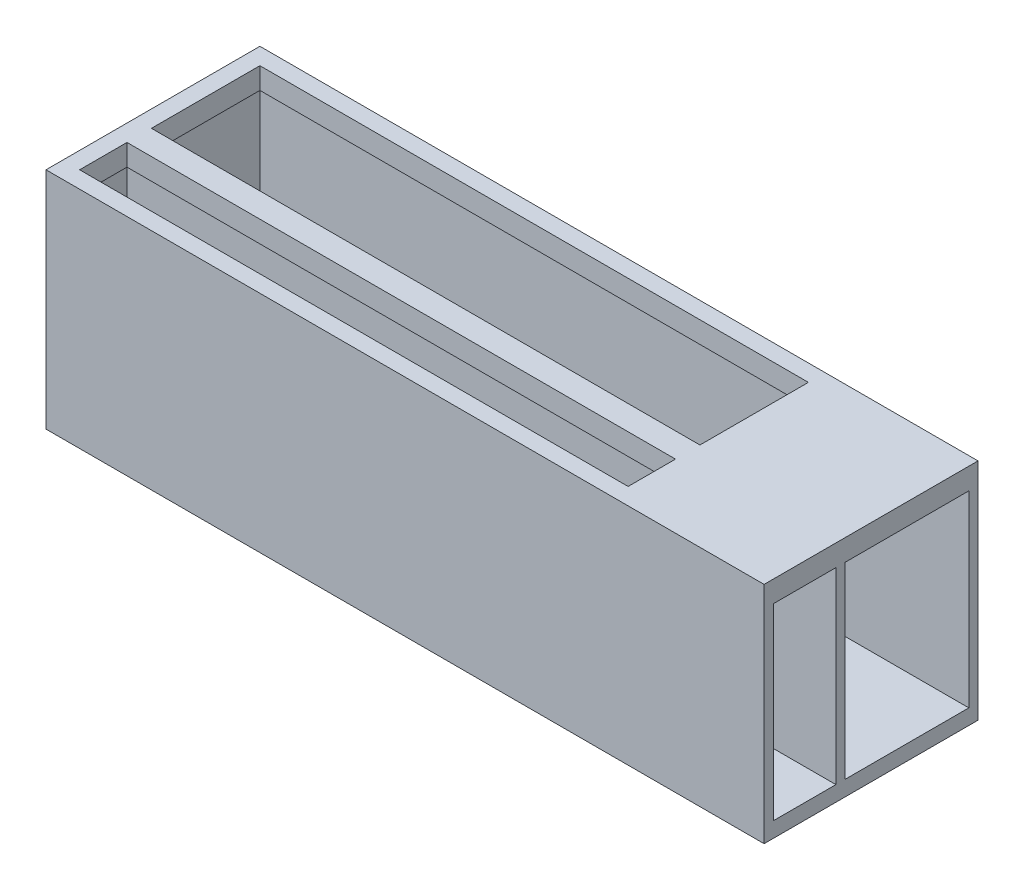
ISO-10303-21;
HEADER;
FILE_DESCRIPTION(('STEP AP214'),'2;1');
FILE_NAME('part.step','',(''),(''),'','','');
FILE_SCHEMA(('AUTOMOTIVE_DESIGN { 1 0 10303 214 1 1 1 1 }'));
ENDSEC;
DATA;
#1=APPLICATION_CONTEXT('core data for automotive mechanical design processes');
#2=APPLICATION_PROTOCOL_DEFINITION('international standard','automotive_design',2000,#1);
#3=PRODUCT_CONTEXT('',#1,'mechanical');
#4=PRODUCT('Part','Part','',(#3));
#5=PRODUCT_RELATED_PRODUCT_CATEGORY('part','',(#4));
#6=PRODUCT_DEFINITION_FORMATION('','',#4);
#7=PRODUCT_DEFINITION_CONTEXT('part definition',#1,'design');
#8=PRODUCT_DEFINITION('design','',#6,#7);
#9=PRODUCT_DEFINITION_SHAPE('','',#8);
#10=(LENGTH_UNIT() NAMED_UNIT(*) SI_UNIT(.MILLI.,.METRE.));
#11=(NAMED_UNIT(*) PLANE_ANGLE_UNIT() SI_UNIT($,.RADIAN.));
#12=(NAMED_UNIT(*) SI_UNIT($,.STERADIAN.) SOLID_ANGLE_UNIT());
#13=UNCERTAINTY_MEASURE_WITH_UNIT(LENGTH_MEASURE(1.E-05),#10,'distance_accuracy_value','');
#14=(GEOMETRIC_REPRESENTATION_CONTEXT(3) GLOBAL_UNCERTAINTY_ASSIGNED_CONTEXT((#13)) GLOBAL_UNIT_ASSIGNED_CONTEXT((#10,
#11,#12)) REPRESENTATION_CONTEXT('',''));
#15=CARTESIAN_POINT('',(0.,0.,0.));
#16=DIRECTION('',(0.,0.,1.));
#17=DIRECTION('',(1.,0.,0.));
#18=AXIS2_PLACEMENT_3D('',#15,#16,#17);
#19=CARTESIAN_POINT('',(0.,37.338,0.));
#20=DIRECTION('',(0.,1.,0.));
#21=DIRECTION('',(0.,0.,1.));
#22=AXIS2_PLACEMENT_3D('',#19,#20,#21);
#23=PLANE('',#22);
#24=DIRECTION('',(0.,0.,1.));
#25=VECTOR('',#24,1.);
#26=CARTESIAN_POINT('',(-59.69,37.338,-17.78));
#27=LINE('',#26,#25);
#28=CARTESIAN_POINT('',(-59.69,37.338,-17.78));
#29=VERTEX_POINT('',#28);
#30=CARTESIAN_POINT('',(-59.69,37.338,17.78));
#31=VERTEX_POINT('',#30);
#32=EDGE_CURVE('E299',#29,#31,#27,.T.);
#33=ORIENTED_EDGE('',*,*,#32,.T.);
#34=DIRECTION('',(1.,0.,0.));
#35=VECTOR('',#34,1.);
#36=CARTESIAN_POINT('',(-59.69,37.338,17.78));
#37=LINE('',#36,#35);
#38=CARTESIAN_POINT('',(59.69,37.338,17.78));
#39=VERTEX_POINT('',#38);
#40=EDGE_CURVE('E302',#31,#39,#37,.T.);
#41=ORIENTED_EDGE('',*,*,#40,.T.);
#42=DIRECTION('',(0.,0.,-1.));
#43=VECTOR('',#42,1.);
#44=CARTESIAN_POINT('',(59.69,37.338,-17.78));
#45=LINE('',#44,#43);
#46=CARTESIAN_POINT('',(59.69,37.338,-17.78));
#47=VERTEX_POINT('',#46);
#48=EDGE_CURVE('E305',#39,#47,#45,.T.);
#49=ORIENTED_EDGE('',*,*,#48,.T.);
#50=DIRECTION('',(-1.,0.,0.));
#51=VECTOR('',#50,1.);
#52=CARTESIAN_POINT('',(-59.69,37.338,-17.78));
#53=LINE('',#52,#51);
#54=EDGE_CURVE('E307',#47,#29,#53,.T.);
#55=ORIENTED_EDGE('',*,*,#54,.T.);
#56=EDGE_LOOP('',(#33,#41,#49,#55));
#57=FACE_BOUND('',#56,.T.);
#58=DIRECTION('',(1.,0.,0.));
#59=VECTOR('',#58,1.);
#60=CARTESIAN_POINT('',(0.,37.338,7.11199999999998));
#61=LINE('',#60,#59);
#62=CARTESIAN_POINT('',(-56.896,37.338,7.11199999999998));
#63=VERTEX_POINT('',#62);
#64=CARTESIAN_POINT('',(34.29,37.338,7.11199999999998));
#65=VERTEX_POINT('',#64);
#66=EDGE_CURVE('E227',#63,#65,#61,.T.);
#67=ORIENTED_EDGE('',*,*,#66,.T.);
#68=DIRECTION('',(0.,0.,1.));
#69=VECTOR('',#68,1.);
#70=CARTESIAN_POINT('',(34.29,37.338,0.));
#71=LINE('',#70,#69);
#72=CARTESIAN_POINT('',(34.29,37.338,14.986));
#73=VERTEX_POINT('',#72);
#74=EDGE_CURVE('E62',#65,#73,#71,.T.);
#75=ORIENTED_EDGE('',*,*,#74,.T.);
#76=DIRECTION('',(1.,0.,0.));
#77=VECTOR('',#76,1.);
#78=CARTESIAN_POINT('',(0.,37.338,14.986));
#79=LINE('',#78,#77);
#80=CARTESIAN_POINT('',(-56.896,37.338,14.986));
#81=VERTEX_POINT('',#80);
#82=EDGE_CURVE('E220',#81,#73,#79,.T.);
#83=ORIENTED_EDGE('',*,*,#82,.F.);
#84=DIRECTION('',(0.,0.,1.));
#85=VECTOR('',#84,1.);
#86=CARTESIAN_POINT('',(-56.896,37.338,0.));
#87=LINE('',#86,#85);
#88=EDGE_CURVE('E224',#63,#81,#87,.T.);
#89=ORIENTED_EDGE('',*,*,#88,.F.);
#90=EDGE_LOOP('',(#67,#75,#83,#89));
#91=FACE_BOUND('',#90,.T.);
#92=DIRECTION('',(1.,0.,0.));
#93=VECTOR('',#92,1.);
#94=CARTESIAN_POINT('',(0.,37.338,-14.986));
#95=LINE('',#94,#93);
#96=CARTESIAN_POINT('',(-56.896,37.338,-14.986));
#97=VERTEX_POINT('',#96);
#98=CARTESIAN_POINT('',(34.29,37.338,-14.986));
#99=VERTEX_POINT('',#98);
#100=EDGE_CURVE('E197',#97,#99,#95,.T.);
#101=ORIENTED_EDGE('',*,*,#100,.T.);
#102=DIRECTION('',(0.,0.,1.));
#103=VECTOR('',#102,1.);
#104=CARTESIAN_POINT('',(34.29,37.338,0.));
#105=LINE('',#104,#103);
#106=CARTESIAN_POINT('',(34.29,37.338,3.04800000000001));
#107=VERTEX_POINT('',#106);
#108=EDGE_CURVE('E54',#99,#107,#105,.T.);
#109=ORIENTED_EDGE('',*,*,#108,.T.);
#110=DIRECTION('',(1.,0.,0.));
#111=VECTOR('',#110,1.);
#112=CARTESIAN_POINT('',(0.,37.338,3.04800000000001));
#113=LINE('',#112,#111);
#114=CARTESIAN_POINT('',(-56.896,37.338,3.04800000000001));
#115=VERTEX_POINT('',#114);
#116=EDGE_CURVE('E186',#115,#107,#113,.T.);
#117=ORIENTED_EDGE('',*,*,#116,.F.);
#118=DIRECTION('',(0.,0.,1.));
#119=VECTOR('',#118,1.);
#120=CARTESIAN_POINT('',(-56.896,37.338,0.));
#121=LINE('',#120,#119);
#122=EDGE_CURVE('E193',#97,#115,#121,.T.);
#123=ORIENTED_EDGE('',*,*,#122,.F.);
#124=EDGE_LOOP('',(#101,#109,#117,#123));
#125=FACE_BOUND('',#124,.T.);
#126=ADVANCED_FACE('F39',(#57,#91,#125),#23,.T.);
#127=CARTESIAN_POINT('',(-97.0979141359151,33.782,4.31799999999998));
#128=DIRECTION('',(0.,1.,0.));
#129=DIRECTION('',(0.,0.,1.));
#130=AXIS2_PLACEMENT_3D('',#127,#128,#129);
#131=PLANE('',#130);
#132=DIRECTION('',(0.,0.,-1.));
#133=VECTOR('',#132,1.);
#134=CARTESIAN_POINT('',(-58.166,33.782,4.31799999999997));
#135=LINE('',#134,#133);
#136=CARTESIAN_POINT('',(-58.166,33.782,4.31800000000001));
#137=VERTEX_POINT('',#136);
#138=CARTESIAN_POINT('',(-58.166,33.782,-16.256));
#139=VERTEX_POINT('',#138);
#140=EDGE_CURVE('E275',#137,#139,#135,.T.);
#141=ORIENTED_EDGE('',*,*,#140,.T.);
#142=DIRECTION('',(1.,0.,0.));
#143=VECTOR('',#142,1.);
#144=CARTESIAN_POINT('',(-97.0979141359151,33.782,-16.256));
#145=LINE('',#144,#143);
#146=CARTESIAN_POINT('',(59.69,33.782,-16.256));
#147=VERTEX_POINT('',#146);
#148=EDGE_CURVE('E292',#139,#147,#145,.T.);
#149=ORIENTED_EDGE('',*,*,#148,.T.);
#150=DIRECTION('',(0.,0.,1.));
#151=VECTOR('',#150,1.);
#152=CARTESIAN_POINT('',(59.69,33.782,4.31800000000001));
#153=LINE('',#152,#151);
#154=CARTESIAN_POINT('',(59.69,33.782,4.31800000000001));
#155=VERTEX_POINT('',#154);
#156=EDGE_CURVE('E287',#147,#155,#153,.T.);
#157=ORIENTED_EDGE('',*,*,#156,.T.);
#158=DIRECTION('',(1.,0.,0.));
#159=VECTOR('',#158,1.);
#160=CARTESIAN_POINT('',(-97.0979141359151,33.782,4.31799999999998));
#161=LINE('',#160,#159);
#162=EDGE_CURVE('E276',#137,#155,#161,.T.);
#163=ORIENTED_EDGE('',*,*,#162,.F.);
#164=EDGE_LOOP('',(#141,#149,#157,#163));
#165=FACE_BOUND('',#164,.T.);
#166=DIRECTION('',(0.,0.,-1.));
#167=VECTOR('',#166,1.);
#168=CARTESIAN_POINT('',(34.29,33.782,0.));
#169=LINE('',#168,#167);
#170=CARTESIAN_POINT('',(34.29,33.782,3.04800000000001));
#171=VERTEX_POINT('',#170);
#172=CARTESIAN_POINT('',(34.29,33.782,-14.986));
#173=VERTEX_POINT('',#172);
#174=EDGE_CURVE('E180',#171,#173,#169,.T.);
#175=ORIENTED_EDGE('',*,*,#174,.T.);
#176=DIRECTION('',(-1.,0.,0.));
#177=VECTOR('',#176,1.);
#178=CARTESIAN_POINT('',(0.,33.782,-14.986));
#179=LINE('',#178,#177);
#180=CARTESIAN_POINT('',(-56.896,33.782,-14.986));
#181=VERTEX_POINT('',#180);
#182=EDGE_CURVE('E212',#173,#181,#179,.T.);
#183=ORIENTED_EDGE('',*,*,#182,.T.);
#184=DIRECTION('',(0.,0.,-1.));
#185=VECTOR('',#184,1.);
#186=CARTESIAN_POINT('',(-56.896,33.782,0.));
#187=LINE('',#186,#185);
#188=CARTESIAN_POINT('',(-56.896,33.782,3.04800000000001));
#189=VERTEX_POINT('',#188);
#190=EDGE_CURVE('E207',#189,#181,#187,.T.);
#191=ORIENTED_EDGE('',*,*,#190,.F.);
#192=DIRECTION('',(-1.,0.,0.));
#193=VECTOR('',#192,1.);
#194=CARTESIAN_POINT('',(0.,33.782,3.04800000000001));
#195=LINE('',#194,#193);
#196=EDGE_CURVE('E192',#171,#189,#195,.T.);
#197=ORIENTED_EDGE('',*,*,#196,.F.);
#198=EDGE_LOOP('',(#175,#183,#191,#197));
#199=FACE_BOUND('',#198,.T.);
#200=ADVANCED_FACE('F352',(#165,#199),#131,.F.);
#201=CARTESIAN_POINT('',(-97.0979141359151,33.782,16.256));
#202=DIRECTION('',(0.,1.,0.));
#203=DIRECTION('',(0.,0.,1.));
#204=AXIS2_PLACEMENT_3D('',#201,#202,#203);
#205=PLANE('',#204);
#206=DIRECTION('',(0.,0.,-1.));
#207=VECTOR('',#206,1.);
#208=CARTESIAN_POINT('',(-58.166,33.782,16.256));
#209=LINE('',#208,#207);
#210=CARTESIAN_POINT('',(-58.166,33.782,16.256));
#211=VERTEX_POINT('',#210);
#212=CARTESIAN_POINT('',(-58.166,33.782,5.84199999999997));
#213=VERTEX_POINT('',#212);
#214=EDGE_CURVE('E245',#211,#213,#209,.T.);
#215=ORIENTED_EDGE('',*,*,#214,.T.);
#216=DIRECTION('',(1.,0.,0.));
#217=VECTOR('',#216,1.);
#218=CARTESIAN_POINT('',(-97.0979141359151,33.782,5.84199999999997));
#219=LINE('',#218,#217);
#220=CARTESIAN_POINT('',(59.69,33.782,5.842));
#221=VERTEX_POINT('',#220);
#222=EDGE_CURVE('E265',#213,#221,#219,.T.);
#223=ORIENTED_EDGE('',*,*,#222,.T.);
#224=DIRECTION('',(0.,0.,1.));
#225=VECTOR('',#224,1.);
#226=CARTESIAN_POINT('',(59.69,33.782,16.256));
#227=LINE('',#226,#225);
#228=CARTESIAN_POINT('',(59.69,33.782,16.256));
#229=VERTEX_POINT('',#228);
#230=EDGE_CURVE('E260',#221,#229,#227,.T.);
#231=ORIENTED_EDGE('',*,*,#230,.T.);
#232=DIRECTION('',(1.,0.,0.));
#233=VECTOR('',#232,1.);
#234=CARTESIAN_POINT('',(-97.0979141359151,33.782,16.256));
#235=LINE('',#234,#233);
#236=EDGE_CURVE('E246',#211,#229,#235,.T.);
#237=ORIENTED_EDGE('',*,*,#236,.F.);
#238=EDGE_LOOP('',(#215,#223,#231,#237));
#239=FACE_BOUND('',#238,.T.);
#240=DIRECTION('',(0.,0.,-1.));
#241=VECTOR('',#240,1.);
#242=CARTESIAN_POINT('',(34.29,33.782,0.));
#243=LINE('',#242,#241);
#244=CARTESIAN_POINT('',(34.29,33.782,14.986));
#245=VERTEX_POINT('',#244);
#246=CARTESIAN_POINT('',(34.29,33.782,7.11199999999998));
#247=VERTEX_POINT('',#246);
#248=EDGE_CURVE('E233',#245,#247,#243,.T.);
#249=ORIENTED_EDGE('',*,*,#248,.T.);
#250=DIRECTION('',(-1.,0.,0.));
#251=VECTOR('',#250,1.);
#252=CARTESIAN_POINT('',(0.,33.782,7.11199999999998));
#253=LINE('',#252,#251);
#254=CARTESIAN_POINT('',(-56.896,33.782,7.11199999999998));
#255=VERTEX_POINT('',#254);
#256=EDGE_CURVE('E215',#247,#255,#253,.T.);
#257=ORIENTED_EDGE('',*,*,#256,.T.);
#258=DIRECTION('',(0.,0.,-1.));
#259=VECTOR('',#258,1.);
#260=CARTESIAN_POINT('',(-56.896,33.782,0.));
#261=LINE('',#260,#259);
#262=CARTESIAN_POINT('',(-56.896,33.782,14.986));
#263=VERTEX_POINT('',#262);
#264=EDGE_CURVE('E205',#263,#255,#261,.T.);
#265=ORIENTED_EDGE('',*,*,#264,.F.);
#266=DIRECTION('',(-1.,0.,0.));
#267=VECTOR('',#266,1.);
#268=CARTESIAN_POINT('',(0.,33.782,14.986));
#269=LINE('',#268,#267);
#270=EDGE_CURVE('E223',#245,#263,#269,.T.);
#271=ORIENTED_EDGE('',*,*,#270,.F.);
#272=EDGE_LOOP('',(#249,#257,#265,#271));
#273=FACE_BOUND('',#272,.T.);
#274=ADVANCED_FACE('F350',(#239,#273),#205,.F.);
#275=CARTESIAN_POINT('',(-59.69,37.338,-17.78));
#276=DIRECTION('',(1.,0.,0.));
#277=DIRECTION('',(0.,0.,-1.));
#278=AXIS2_PLACEMENT_3D('',#275,#276,#277);
#279=PLANE('',#278);
#280=DIRECTION('',(0.,0.,1.));
#281=VECTOR('',#280,1.);
#282=CARTESIAN_POINT('',(-59.69,0.,-17.78));
#283=LINE('',#282,#281);
#284=CARTESIAN_POINT('',(-59.69,0.,-17.78));
#285=VERTEX_POINT('',#284);
#286=CARTESIAN_POINT('',(-59.69,0.,17.78));
#287=VERTEX_POINT('',#286);
#288=EDGE_CURVE('E272',#285,#287,#283,.T.);
#289=ORIENTED_EDGE('',*,*,#288,.T.);
#290=DIRECTION('',(0.,-1.,0.));
#291=VECTOR('',#290,1.);
#292=CARTESIAN_POINT('',(-59.69,37.338,17.78));
#293=LINE('',#292,#291);
#294=EDGE_CURVE('E12',#31,#287,#293,.T.);
#295=ORIENTED_EDGE('',*,*,#294,.F.);
#296=ORIENTED_EDGE('',*,*,#32,.F.);
#297=DIRECTION('',(0.,-1.,0.));
#298=VECTOR('',#297,1.);
#299=CARTESIAN_POINT('',(-59.69,37.338,-17.78));
#300=LINE('',#299,#298);
#301=EDGE_CURVE('E309',#29,#285,#300,.T.);
#302=ORIENTED_EDGE('',*,*,#301,.T.);
#303=EDGE_LOOP('',(#289,#295,#296,#302));
#304=FACE_BOUND('',#303,.T.);
#305=ADVANCED_FACE('F41',(#304),#279,.F.);
#306=CARTESIAN_POINT('',(-59.69,37.338,17.78));
#307=DIRECTION('',(0.,0.,-1.));
#308=DIRECTION('',(-1.,0.,0.));
#309=AXIS2_PLACEMENT_3D('',#306,#307,#308);
#310=PLANE('',#309);
#311=DIRECTION('',(1.,0.,0.));
#312=VECTOR('',#311,1.);
#313=CARTESIAN_POINT('',(-59.69,0.,17.78));
#314=LINE('',#313,#312);
#315=CARTESIAN_POINT('',(59.69,0.,17.78));
#316=VERTEX_POINT('',#315);
#317=EDGE_CURVE('E312',#287,#316,#314,.T.);
#318=ORIENTED_EDGE('',*,*,#317,.T.);
#319=DIRECTION('',(0.,-1.,0.));
#320=VECTOR('',#319,1.);
#321=CARTESIAN_POINT('',(59.69,37.338,17.78));
#322=LINE('',#321,#320);
#323=EDGE_CURVE('E47',#39,#316,#322,.T.);
#324=ORIENTED_EDGE('',*,*,#323,.F.);
#325=ORIENTED_EDGE('',*,*,#40,.F.);
#326=ORIENTED_EDGE('',*,*,#294,.T.);
#327=EDGE_LOOP('',(#318,#324,#325,#326));
#328=FACE_BOUND('',#327,.T.);
#329=ADVANCED_FACE('F342',(#328),#310,.F.);
#330=CARTESIAN_POINT('',(59.69,37.338,-17.78));
#331=DIRECTION('',(-1.,0.,0.));
#332=DIRECTION('',(0.,0.,1.));
#333=AXIS2_PLACEMENT_3D('',#330,#331,#332);
#334=PLANE('',#333);
#335=DIRECTION('',(0.,0.,-1.));
#336=VECTOR('',#335,1.);
#337=CARTESIAN_POINT('',(59.69,2.54,16.256));
#338=LINE('',#337,#336);
#339=CARTESIAN_POINT('',(59.69,2.54,16.256));
#340=VERTEX_POINT('',#339);
#341=CARTESIAN_POINT('',(59.69,2.54,5.84199999999999));
#342=VERTEX_POINT('',#341);
#343=EDGE_CURVE('E253',#340,#342,#338,.T.);
#344=ORIENTED_EDGE('',*,*,#343,.F.);
#345=DIRECTION('',(0.,-1.,0.));
#346=VECTOR('',#345,1.);
#347=CARTESIAN_POINT('',(59.69,33.782,16.256));
#348=LINE('',#347,#346);
#349=EDGE_CURVE('E251',#229,#340,#348,.T.);
#350=ORIENTED_EDGE('',*,*,#349,.F.);
#351=ORIENTED_EDGE('',*,*,#230,.F.);
#352=DIRECTION('',(0.,1.,0.));
#353=VECTOR('',#352,1.);
#354=CARTESIAN_POINT('',(59.69,33.782,5.842));
#355=LINE('',#354,#353);
#356=EDGE_CURVE('E257',#342,#221,#355,.T.);
#357=ORIENTED_EDGE('',*,*,#356,.F.);
#358=EDGE_LOOP('',(#344,#350,#351,#357));
#359=FACE_BOUND('',#358,.T.);
#360=DIRECTION('',(0.,0.,-1.));
#361=VECTOR('',#360,1.);
#362=CARTESIAN_POINT('',(59.69,2.54,4.318));
#363=LINE('',#362,#361);
#364=CARTESIAN_POINT('',(59.69,2.54,4.318));
#365=VERTEX_POINT('',#364);
#366=CARTESIAN_POINT('',(59.69,2.54,-16.256));
#367=VERTEX_POINT('',#366);
#368=EDGE_CURVE('E281',#365,#367,#363,.T.);
#369=ORIENTED_EDGE('',*,*,#368,.F.);
#370=DIRECTION('',(0.,-1.,0.));
#371=VECTOR('',#370,1.);
#372=CARTESIAN_POINT('',(59.69,33.782,4.31800000000001));
#373=LINE('',#372,#371);
#374=EDGE_CURVE('E209',#155,#365,#373,.T.);
#375=ORIENTED_EDGE('',*,*,#374,.F.);
#376=ORIENTED_EDGE('',*,*,#156,.F.);
#377=DIRECTION('',(0.,1.,0.));
#378=VECTOR('',#377,1.);
#379=CARTESIAN_POINT('',(59.69,33.782,-16.256));
#380=LINE('',#379,#378);
#381=EDGE_CURVE('E284',#367,#147,#380,.T.);
#382=ORIENTED_EDGE('',*,*,#381,.F.);
#383=EDGE_LOOP('',(#369,#375,#376,#382));
#384=FACE_BOUND('',#383,.T.);
#385=DIRECTION('',(0.,0.,-1.));
#386=VECTOR('',#385,1.);
#387=CARTESIAN_POINT('',(59.69,0.,-17.78));
#388=LINE('',#387,#386);
#389=CARTESIAN_POINT('',(59.69,0.,-17.78));
#390=VERTEX_POINT('',#389);
#391=EDGE_CURVE('E314',#316,#390,#388,.T.);
#392=ORIENTED_EDGE('',*,*,#391,.T.);
#393=DIRECTION('',(0.,-1.,0.));
#394=VECTOR('',#393,1.);
#395=CARTESIAN_POINT('',(59.69,37.338,-17.78));
#396=LINE('',#395,#394);
#397=EDGE_CURVE('E319',#47,#390,#396,.T.);
#398=ORIENTED_EDGE('',*,*,#397,.F.);
#399=ORIENTED_EDGE('',*,*,#48,.F.);
#400=ORIENTED_EDGE('',*,*,#323,.T.);
#401=EDGE_LOOP('',(#392,#398,#399,#400));
#402=FACE_BOUND('',#401,.T.);
#403=ADVANCED_FACE('F326',(#359,#384,#402),#334,.F.);
#404=CARTESIAN_POINT('',(-59.69,37.338,-17.78));
#405=DIRECTION('',(0.,0.,1.));
#406=DIRECTION('',(1.,0.,0.));
#407=AXIS2_PLACEMENT_3D('',#404,#405,#406);
#408=PLANE('',#407);
#409=DIRECTION('',(-1.,0.,0.));
#410=VECTOR('',#409,1.);
#411=CARTESIAN_POINT('',(-59.69,0.,-17.78));
#412=LINE('',#411,#410);
#413=EDGE_CURVE('E303',#390,#285,#412,.T.);
#414=ORIENTED_EDGE('',*,*,#413,.T.);
#415=ORIENTED_EDGE('',*,*,#301,.F.);
#416=ORIENTED_EDGE('',*,*,#54,.F.);
#417=ORIENTED_EDGE('',*,*,#397,.T.);
#418=EDGE_LOOP('',(#414,#415,#416,#417));
#419=FACE_BOUND('',#418,.T.);
#420=ADVANCED_FACE('F335',(#419),#408,.F.);
#421=CARTESIAN_POINT('',(0.,0.,0.));
#422=DIRECTION('',(0.,1.,0.));
#423=DIRECTION('',(0.,0.,1.));
#424=AXIS2_PLACEMENT_3D('',#421,#422,#423);
#425=PLANE('',#424);
#426=ORIENTED_EDGE('',*,*,#288,.F.);
#427=ORIENTED_EDGE('',*,*,#413,.F.);
#428=ORIENTED_EDGE('',*,*,#391,.F.);
#429=ORIENTED_EDGE('',*,*,#317,.F.);
#430=EDGE_LOOP('',(#426,#427,#428,#429));
#431=FACE_BOUND('',#430,.T.);
#432=ADVANCED_FACE('F332',(#431),#425,.F.);
#433=CARTESIAN_POINT('',(-97.0979141359151,33.782,4.31799999999998));
#434=DIRECTION('',(0.,0.,1.));
#435=DIRECTION('',(1.,0.,0.));
#436=AXIS2_PLACEMENT_3D('',#433,#434,#435);
#437=PLANE('',#436);
#438=DIRECTION('',(0.,1.,0.));
#439=VECTOR('',#438,1.);
#440=CARTESIAN_POINT('',(-58.166,33.782,4.31799999999998));
#441=LINE('',#440,#439);
#442=CARTESIAN_POINT('',(-58.166,2.54,4.318));
#443=VERTEX_POINT('',#442);
#444=EDGE_CURVE('E278',#443,#137,#441,.T.);
#445=ORIENTED_EDGE('',*,*,#444,.T.);
#446=ORIENTED_EDGE('',*,*,#162,.T.);
#447=ORIENTED_EDGE('',*,*,#374,.T.);
#448=DIRECTION('',(1.,0.,0.));
#449=VECTOR('',#448,1.);
#450=CARTESIAN_POINT('',(-97.0979141359151,2.54,4.31799999999997));
#451=LINE('',#450,#449);
#452=EDGE_CURVE('E290',#443,#365,#451,.T.);
#453=ORIENTED_EDGE('',*,*,#452,.F.);
#454=EDGE_LOOP('',(#445,#446,#447,#453));
#455=FACE_BOUND('',#454,.T.);
#456=ADVANCED_FACE('F361',(#455),#437,.F.);
#457=CARTESIAN_POINT('',(-97.0979141359151,33.782,-16.256));
#458=DIRECTION('',(0.,0.,-1.));
#459=DIRECTION('',(-1.,0.,0.));
#460=AXIS2_PLACEMENT_3D('',#457,#458,#459);
#461=PLANE('',#460);
#462=DIRECTION('',(0.,-1.,0.));
#463=VECTOR('',#462,1.);
#464=CARTESIAN_POINT('',(-58.166,33.782,-16.256));
#465=LINE('',#464,#463);
#466=CARTESIAN_POINT('',(-58.166,2.54,-16.256));
#467=VERTEX_POINT('',#466);
#468=EDGE_CURVE('E273',#139,#467,#465,.T.);
#469=ORIENTED_EDGE('',*,*,#468,.T.);
#470=DIRECTION('',(1.,0.,0.));
#471=VECTOR('',#470,1.);
#472=CARTESIAN_POINT('',(-97.0979141359151,2.54,-16.256));
#473=LINE('',#472,#471);
#474=EDGE_CURVE('E294',#467,#367,#473,.T.);
#475=ORIENTED_EDGE('',*,*,#474,.T.);
#476=ORIENTED_EDGE('',*,*,#381,.T.);
#477=ORIENTED_EDGE('',*,*,#148,.F.);
#478=EDGE_LOOP('',(#469,#475,#476,#477));
#479=FACE_BOUND('',#478,.T.);
#480=ADVANCED_FACE('F380',(#479),#461,.F.);
#481=CARTESIAN_POINT('',(-97.0979141359151,2.54,4.31799999999997));
#482=DIRECTION('',(0.,-1.,0.));
#483=DIRECTION('',(0.,0.,-1.));
#484=AXIS2_PLACEMENT_3D('',#481,#482,#483);
#485=PLANE('',#484);
#486=DIRECTION('',(0.,0.,1.));
#487=VECTOR('',#486,1.);
#488=CARTESIAN_POINT('',(-58.166,2.54,4.31799999999996));
#489=LINE('',#488,#487);
#490=EDGE_CURVE('E254',#467,#443,#489,.T.);
#491=ORIENTED_EDGE('',*,*,#490,.T.);
#492=ORIENTED_EDGE('',*,*,#452,.T.);
#493=ORIENTED_EDGE('',*,*,#368,.T.);
#494=ORIENTED_EDGE('',*,*,#474,.F.);
#495=EDGE_LOOP('',(#491,#492,#493,#494));
#496=FACE_BOUND('',#495,.T.);
#497=ADVANCED_FACE('F387',(#496),#485,.F.);
#498=CARTESIAN_POINT('',(-58.166,37.338,-17.78));
#499=DIRECTION('',(1.,0.,0.));
#500=DIRECTION('',(0.,0.,-1.));
#501=AXIS2_PLACEMENT_3D('',#498,#499,#500);
#502=PLANE('',#501);
#503=ORIENTED_EDGE('',*,*,#444,.F.);
#504=ORIENTED_EDGE('',*,*,#490,.F.);
#505=ORIENTED_EDGE('',*,*,#468,.F.);
#506=ORIENTED_EDGE('',*,*,#140,.F.);
#507=EDGE_LOOP('',(#503,#504,#505,#506));
#508=FACE_BOUND('',#507,.T.);
#509=ADVANCED_FACE('F395',(#508),#502,.T.);
#510=CARTESIAN_POINT('',(-97.0979141359151,33.782,16.256));
#511=DIRECTION('',(0.,0.,1.));
#512=DIRECTION('',(1.,0.,0.));
#513=AXIS2_PLACEMENT_3D('',#510,#511,#512);
#514=PLANE('',#513);
#515=DIRECTION('',(0.,1.,0.));
#516=VECTOR('',#515,1.);
#517=CARTESIAN_POINT('',(-58.166,33.782,16.256));
#518=LINE('',#517,#516);
#519=CARTESIAN_POINT('',(-58.166,2.54,16.256));
#520=VERTEX_POINT('',#519);
#521=EDGE_CURVE('E248',#520,#211,#518,.T.);
#522=ORIENTED_EDGE('',*,*,#521,.T.);
#523=ORIENTED_EDGE('',*,*,#236,.T.);
#524=ORIENTED_EDGE('',*,*,#349,.T.);
#525=DIRECTION('',(1.,0.,0.));
#526=VECTOR('',#525,1.);
#527=CARTESIAN_POINT('',(-97.0979141359151,2.54,16.256));
#528=LINE('',#527,#526);
#529=EDGE_CURVE('E263',#520,#340,#528,.T.);
#530=ORIENTED_EDGE('',*,*,#529,.F.);
#531=EDGE_LOOP('',(#522,#523,#524,#530));
#532=FACE_BOUND('',#531,.T.);
#533=ADVANCED_FACE('F402',(#532),#514,.F.);
#534=CARTESIAN_POINT('',(-97.0979141359151,33.782,5.84199999999997));
#535=DIRECTION('',(0.,0.,-1.));
#536=DIRECTION('',(-1.,0.,0.));
#537=AXIS2_PLACEMENT_3D('',#534,#535,#536);
#538=PLANE('',#537);
#539=DIRECTION('',(0.,-1.,0.));
#540=VECTOR('',#539,1.);
#541=CARTESIAN_POINT('',(-58.166,33.782,5.84199999999997));
#542=LINE('',#541,#540);
#543=CARTESIAN_POINT('',(-58.166,2.54,5.84199999999997));
#544=VERTEX_POINT('',#543);
#545=EDGE_CURVE('E243',#213,#544,#542,.T.);
#546=ORIENTED_EDGE('',*,*,#545,.T.);
#547=DIRECTION('',(1.,0.,0.));
#548=VECTOR('',#547,1.);
#549=CARTESIAN_POINT('',(-97.0979141359151,2.54,5.84199999999996));
#550=LINE('',#549,#548);
#551=EDGE_CURVE('E267',#544,#342,#550,.T.);
#552=ORIENTED_EDGE('',*,*,#551,.T.);
#553=ORIENTED_EDGE('',*,*,#356,.T.);
#554=ORIENTED_EDGE('',*,*,#222,.F.);
#555=EDGE_LOOP('',(#546,#552,#553,#554));
#556=FACE_BOUND('',#555,.T.);
#557=ADVANCED_FACE('F410',(#556),#538,.F.);
#558=CARTESIAN_POINT('',(-97.0979141359151,2.54,16.256));
#559=DIRECTION('',(0.,-1.,0.));
#560=DIRECTION('',(0.,0.,-1.));
#561=AXIS2_PLACEMENT_3D('',#558,#559,#560);
#562=PLANE('',#561);
#563=DIRECTION('',(0.,0.,1.));
#564=VECTOR('',#563,1.);
#565=CARTESIAN_POINT('',(-58.166,2.54,16.256));
#566=LINE('',#565,#564);
#567=EDGE_CURVE('E250',#544,#520,#566,.T.);
#568=ORIENTED_EDGE('',*,*,#567,.T.);
#569=ORIENTED_EDGE('',*,*,#529,.T.);
#570=ORIENTED_EDGE('',*,*,#343,.T.);
#571=ORIENTED_EDGE('',*,*,#551,.F.);
#572=EDGE_LOOP('',(#568,#569,#570,#571));
#573=FACE_BOUND('',#572,.T.);
#574=ADVANCED_FACE('F418',(#573),#562,.F.);
#575=CARTESIAN_POINT('',(-58.166,37.338,-17.78));
#576=DIRECTION('',(1.,0.,0.));
#577=DIRECTION('',(0.,0.,-1.));
#578=AXIS2_PLACEMENT_3D('',#575,#576,#577);
#579=PLANE('',#578);
#580=ORIENTED_EDGE('',*,*,#521,.F.);
#581=ORIENTED_EDGE('',*,*,#567,.F.);
#582=ORIENTED_EDGE('',*,*,#545,.F.);
#583=ORIENTED_EDGE('',*,*,#214,.F.);
#584=EDGE_LOOP('',(#580,#581,#582,#583));
#585=FACE_BOUND('',#584,.T.);
#586=ADVANCED_FACE('F426',(#585),#579,.T.);
#587=CARTESIAN_POINT('',(34.29,-0.001000000000001,0.));
#588=DIRECTION('',(-1.,0.,0.));
#589=DIRECTION('',(0.,0.,1.));
#590=AXIS2_PLACEMENT_3D('',#587,#588,#589);
#591=PLANE('',#590);
#592=DIRECTION('',(0.,1.,0.));
#593=VECTOR('',#592,1.);
#594=CARTESIAN_POINT('',(34.29,-0.001000000000001,14.986));
#595=LINE('',#594,#593);
#596=EDGE_CURVE('E231',#245,#73,#595,.T.);
#597=ORIENTED_EDGE('',*,*,#596,.T.);
#598=ORIENTED_EDGE('',*,*,#74,.F.);
#599=DIRECTION('',(0.,1.,0.));
#600=VECTOR('',#599,1.);
#601=CARTESIAN_POINT('',(34.29,-0.001000000000001,7.11199999999998));
#602=LINE('',#601,#600);
#603=EDGE_CURVE('E232',#247,#65,#602,.T.);
#604=ORIENTED_EDGE('',*,*,#603,.F.);
#605=ORIENTED_EDGE('',*,*,#248,.F.);
#606=EDGE_LOOP('',(#597,#598,#604,#605));
#607=FACE_BOUND('',#606,.T.);
#608=ADVANCED_FACE('F434',(#607),#591,.T.);
#609=CARTESIAN_POINT('',(0.,-0.001000000000001,14.986));
#610=DIRECTION('',(0.,0.,1.));
#611=DIRECTION('',(1.,0.,0.));
#612=AXIS2_PLACEMENT_3D('',#609,#610,#611);
#613=PLANE('',#612);
#614=ORIENTED_EDGE('',*,*,#270,.T.);
#615=DIRECTION('',(0.,1.,0.));
#616=VECTOR('',#615,1.);
#617=CARTESIAN_POINT('',(-56.896,-0.001000000000001,14.986));
#618=LINE('',#617,#616);
#619=EDGE_CURVE('E219',#263,#81,#618,.T.);
#620=ORIENTED_EDGE('',*,*,#619,.T.);
#621=ORIENTED_EDGE('',*,*,#82,.T.);
#622=ORIENTED_EDGE('',*,*,#596,.F.);
#623=EDGE_LOOP('',(#614,#620,#621,#622));
#624=FACE_BOUND('',#623,.T.);
#625=ADVANCED_FACE('F442',(#624),#613,.F.);
#626=CARTESIAN_POINT('',(-56.896,-0.001000000000001,0.));
#627=DIRECTION('',(-1.,0.,0.));
#628=DIRECTION('',(0.,0.,1.));
#629=AXIS2_PLACEMENT_3D('',#626,#627,#628);
#630=PLANE('',#629);
#631=ORIENTED_EDGE('',*,*,#264,.T.);
#632=DIRECTION('',(0.,1.,0.));
#633=VECTOR('',#632,1.);
#634=CARTESIAN_POINT('',(-56.896,-0.001000000000001,7.11199999999998));
#635=LINE('',#634,#633);
#636=EDGE_CURVE('E218',#255,#63,#635,.T.);
#637=ORIENTED_EDGE('',*,*,#636,.T.);
#638=ORIENTED_EDGE('',*,*,#88,.T.);
#639=ORIENTED_EDGE('',*,*,#619,.F.);
#640=EDGE_LOOP('',(#631,#637,#638,#639));
#641=FACE_BOUND('',#640,.T.);
#642=ADVANCED_FACE('F450',(#641),#630,.F.);
#643=CARTESIAN_POINT('',(0.,-0.001000000000001,7.11199999999998));
#644=DIRECTION('',(0.,0.,1.));
#645=DIRECTION('',(1.,0.,0.));
#646=AXIS2_PLACEMENT_3D('',#643,#644,#645);
#647=PLANE('',#646);
#648=ORIENTED_EDGE('',*,*,#603,.T.);
#649=ORIENTED_EDGE('',*,*,#66,.F.);
#650=ORIENTED_EDGE('',*,*,#636,.F.);
#651=ORIENTED_EDGE('',*,*,#256,.F.);
#652=EDGE_LOOP('',(#648,#649,#650,#651));
#653=FACE_BOUND('',#652,.T.);
#654=ADVANCED_FACE('F458',(#653),#647,.T.);
#655=CARTESIAN_POINT('',(34.29,-0.001000000000001,0.));
#656=DIRECTION('',(-1.,0.,0.));
#657=DIRECTION('',(0.,0.,1.));
#658=AXIS2_PLACEMENT_3D('',#655,#656,#657);
#659=PLANE('',#658);
#660=DIRECTION('',(0.,1.,0.));
#661=VECTOR('',#660,1.);
#662=CARTESIAN_POINT('',(34.29,-0.001000000000001,3.04800000000001));
#663=LINE('',#662,#661);
#664=EDGE_CURVE('E176',#171,#107,#663,.T.);
#665=ORIENTED_EDGE('',*,*,#664,.T.);
#666=ORIENTED_EDGE('',*,*,#108,.F.);
#667=DIRECTION('',(0.,1.,0.));
#668=VECTOR('',#667,1.);
#669=CARTESIAN_POINT('',(34.29,-0.001000000000001,-14.986));
#670=LINE('',#669,#668);
#671=EDGE_CURVE('E198',#173,#99,#670,.T.);
#672=ORIENTED_EDGE('',*,*,#671,.F.);
#673=ORIENTED_EDGE('',*,*,#174,.F.);
#674=EDGE_LOOP('',(#665,#666,#672,#673));
#675=FACE_BOUND('',#674,.T.);
#676=ADVANCED_FACE('F178',(#675),#659,.T.);
#677=CARTESIAN_POINT('',(0.,-0.001000000000001,3.04800000000001));
#678=DIRECTION('',(0.,0.,1.));
#679=DIRECTION('',(1.,0.,0.));
#680=AXIS2_PLACEMENT_3D('',#677,#678,#679);
#681=PLANE('',#680);
#682=ORIENTED_EDGE('',*,*,#196,.T.);
#683=DIRECTION('',(0.,1.,0.));
#684=VECTOR('',#683,1.);
#685=CARTESIAN_POINT('',(-56.896,-0.001000000000001,3.04800000000001));
#686=LINE('',#685,#684);
#687=EDGE_CURVE('E183',#189,#115,#686,.T.);
#688=ORIENTED_EDGE('',*,*,#687,.T.);
#689=ORIENTED_EDGE('',*,*,#116,.T.);
#690=ORIENTED_EDGE('',*,*,#664,.F.);
#691=EDGE_LOOP('',(#682,#688,#689,#690));
#692=FACE_BOUND('',#691,.T.);
#693=ADVANCED_FACE('F187',(#692),#681,.F.);
#694=CARTESIAN_POINT('',(-56.896,-0.001000000000001,0.));
#695=DIRECTION('',(-1.,0.,0.));
#696=DIRECTION('',(0.,0.,1.));
#697=AXIS2_PLACEMENT_3D('',#694,#695,#696);
#698=PLANE('',#697);
#699=ORIENTED_EDGE('',*,*,#190,.T.);
#700=DIRECTION('',(0.,1.,0.));
#701=VECTOR('',#700,1.);
#702=CARTESIAN_POINT('',(-56.896,-0.001000000000001,-14.986));
#703=LINE('',#702,#701);
#704=EDGE_CURVE('E213',#181,#97,#703,.T.);
#705=ORIENTED_EDGE('',*,*,#704,.T.);
#706=ORIENTED_EDGE('',*,*,#122,.T.);
#707=ORIENTED_EDGE('',*,*,#687,.F.);
#708=EDGE_LOOP('',(#699,#705,#706,#707));
#709=FACE_BOUND('',#708,.T.);
#710=ADVANCED_FACE('F479',(#709),#698,.F.);
#711=CARTESIAN_POINT('',(0.,-0.001000000000001,-14.986));
#712=DIRECTION('',(0.,0.,1.));
#713=DIRECTION('',(1.,0.,0.));
#714=AXIS2_PLACEMENT_3D('',#711,#712,#713);
#715=PLANE('',#714);
#716=ORIENTED_EDGE('',*,*,#671,.T.);
#717=ORIENTED_EDGE('',*,*,#100,.F.);
#718=ORIENTED_EDGE('',*,*,#704,.F.);
#719=ORIENTED_EDGE('',*,*,#182,.F.);
#720=EDGE_LOOP('',(#716,#717,#718,#719));
#721=FACE_BOUND('',#720,.T.);
#722=ADVANCED_FACE('F486',(#721),#715,.T.);
#723=CLOSED_SHELL('',(#126,#200,#274,#305,#329,#403,#420,#432,#456,#480,#497,#509,#533,#557,
#574,#586,#608,#625,#642,#654,#676,#693,#710,#722));
#724=MANIFOLD_SOLID_BREP('B2',#723);
#725=ADVANCED_BREP_SHAPE_REPRESENTATION('',(#18,#724),#14);
#726=SHAPE_DEFINITION_REPRESENTATION(#9,#725);
ENDSEC;
END-ISO-10303-21;
